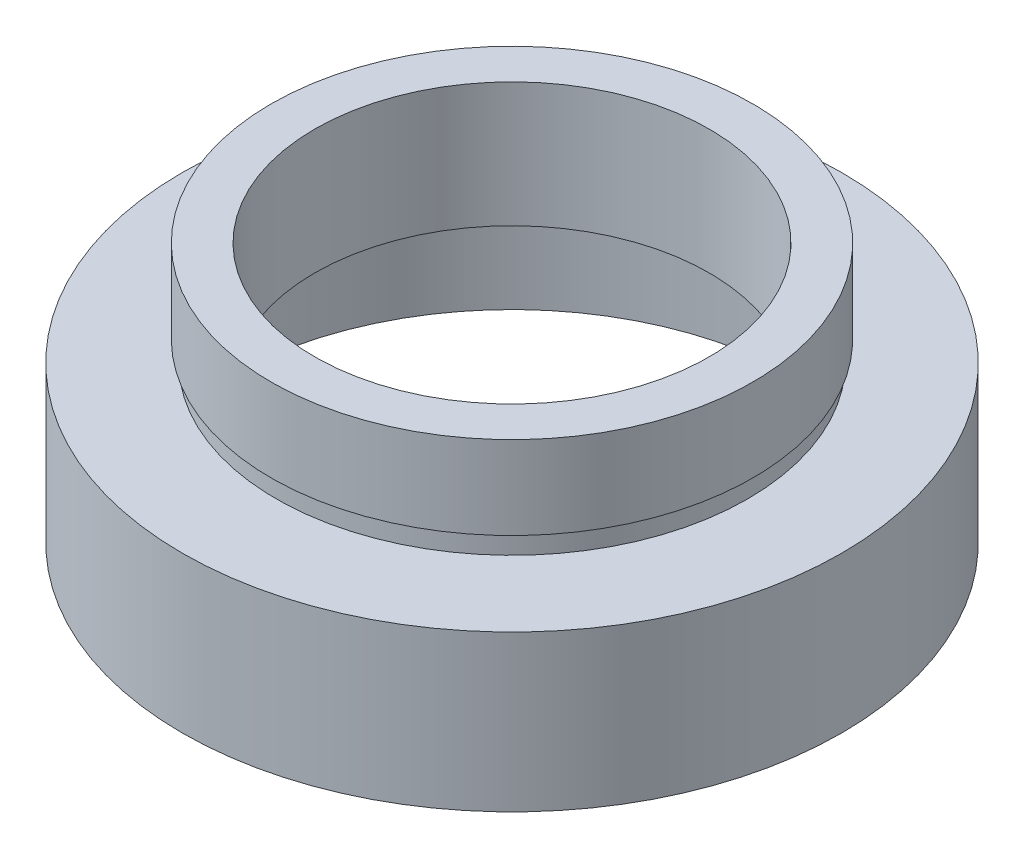
ISO-10303-21;
HEADER;
FILE_DESCRIPTION(('STEP AP214'),'2;1');
FILE_NAME('part.step','',(''),(''),'','','');
FILE_SCHEMA(('AUTOMOTIVE_DESIGN { 1 0 10303 214 1 1 1 1 }'));
ENDSEC;
DATA;
#1=APPLICATION_CONTEXT('core data for automotive mechanical design processes');
#2=APPLICATION_PROTOCOL_DEFINITION('international standard','automotive_design',2000,#1);
#3=PRODUCT_CONTEXT('',#1,'mechanical');
#4=PRODUCT('Part','Part','',(#3));
#5=PRODUCT_RELATED_PRODUCT_CATEGORY('part','',(#4));
#6=PRODUCT_DEFINITION_FORMATION('','',#4);
#7=PRODUCT_DEFINITION_CONTEXT('part definition',#1,'design');
#8=PRODUCT_DEFINITION('design','',#6,#7);
#9=PRODUCT_DEFINITION_SHAPE('','',#8);
#10=(LENGTH_UNIT() NAMED_UNIT(*) SI_UNIT(.MILLI.,.METRE.));
#11=(NAMED_UNIT(*) PLANE_ANGLE_UNIT() SI_UNIT($,.RADIAN.));
#12=(NAMED_UNIT(*) SI_UNIT($,.STERADIAN.) SOLID_ANGLE_UNIT());
#13=UNCERTAINTY_MEASURE_WITH_UNIT(LENGTH_MEASURE(1.E-05),#10,'distance_accuracy_value','');
#14=(GEOMETRIC_REPRESENTATION_CONTEXT(3) GLOBAL_UNCERTAINTY_ASSIGNED_CONTEXT((#13)) GLOBAL_UNIT_ASSIGNED_CONTEXT((#10,
#11,#12)) REPRESENTATION_CONTEXT('',''));
#15=CARTESIAN_POINT('',(0.,0.,0.));
#16=DIRECTION('',(0.,0.,1.));
#17=DIRECTION('',(1.,0.,0.));
#18=AXIS2_PLACEMENT_3D('',#15,#16,#17);
#19=CARTESIAN_POINT('',(15.875,0.,0.));
#20=DIRECTION('',(0.,1.,0.));
#21=DIRECTION('',(-1.,0.,0.));
#22=AXIS2_PLACEMENT_3D('',#19,#20,#21);
#23=PLANE('',#22);
#24=CARTESIAN_POINT('',(0.,0.,0.));
#25=DIRECTION('',(0.,1.,0.));
#26=DIRECTION('',(-1.,0.,0.));
#27=AXIS2_PLACEMENT_3D('',#24,#25,#26);
#28=CIRCLE('',#27,15.875);
#29=CARTESIAN_POINT('',(-15.875,0.,0.));
#30=VERTEX_POINT('',#29);
#31=EDGE_CURVE('E75',#30,#30,#28,.T.);
#32=ORIENTED_EDGE('',*,*,#31,.F.);
#33=EDGE_LOOP('',(#32));
#34=FACE_BOUND('',#33,.T.);
#35=CARTESIAN_POINT('',(0.,0.,0.));
#36=DIRECTION('',(0.,1.,0.));
#37=DIRECTION('',(-1.,0.,0.));
#38=AXIS2_PLACEMENT_3D('',#35,#36,#37);
#39=CIRCLE('',#38,13.75);
#40=CARTESIAN_POINT('',(-13.75,0.,0.));
#41=VERTEX_POINT('',#40);
#42=EDGE_CURVE('E10',#41,#41,#39,.T.);
#43=ORIENTED_EDGE('',*,*,#42,.T.);
#44=EDGE_LOOP('',(#43));
#45=FACE_BOUND('',#44,.T.);
#46=ADVANCED_FACE('F35',(#34,#45),#23,.F.);
#47=CARTESIAN_POINT('',(0.,16.8860182370821,0.));
#48=DIRECTION('',(0.,1.,0.));
#49=DIRECTION('',(-1.,0.,0.));
#50=AXIS2_PLACEMENT_3D('',#47,#48,#49);
#51=CYLINDRICAL_SURFACE('',#50,13.75);
#52=ORIENTED_EDGE('',*,*,#42,.F.);
#53=EDGE_LOOP('',(#52));
#54=FACE_BOUND('',#53,.T.);
#55=CARTESIAN_POINT('',(0.,5.5,0.));
#56=DIRECTION('',(0.,1.,0.));
#57=DIRECTION('',(-1.,0.,0.));
#58=AXIS2_PLACEMENT_3D('',#55,#56,#57);
#59=CIRCLE('',#58,13.75);
#60=CARTESIAN_POINT('',(-13.75,5.49999999999999,0.));
#61=VERTEX_POINT('',#60);
#62=EDGE_CURVE('E41',#61,#61,#59,.T.);
#63=ORIENTED_EDGE('',*,*,#62,.T.);
#64=EDGE_LOOP('',(#63));
#65=FACE_BOUND('',#64,.T.);
#66=ADVANCED_FACE('F82',(#54,#65),#51,.F.);
#67=CARTESIAN_POINT('',(13.75,5.5,0.));
#68=DIRECTION('',(0.,-1.,0.));
#69=DIRECTION('',(1.,0.,0.));
#70=AXIS2_PLACEMENT_3D('',#67,#68,#69);
#71=PLANE('',#70);
#72=ORIENTED_EDGE('',*,*,#62,.F.);
#73=EDGE_LOOP('',(#72));
#74=FACE_BOUND('',#73,.T.);
#75=CARTESIAN_POINT('',(0.,5.5,0.));
#76=DIRECTION('',(0.,1.,0.));
#77=DIRECTION('',(-1.,0.,0.));
#78=AXIS2_PLACEMENT_3D('',#75,#76,#77);
#79=CIRCLE('',#78,14.35);
#80=CARTESIAN_POINT('',(-14.35,5.49999999999999,0.));
#81=VERTEX_POINT('',#80);
#82=EDGE_CURVE('E45',#81,#81,#79,.T.);
#83=ORIENTED_EDGE('',*,*,#82,.T.);
#84=EDGE_LOOP('',(#83));
#85=FACE_BOUND('',#84,.T.);
#86=ADVANCED_FACE('F86',(#74,#85),#71,.F.);
#87=CARTESIAN_POINT('',(0.,16.8860182370821,0.));
#88=DIRECTION('',(0.,1.,0.));
#89=DIRECTION('',(-1.,0.,0.));
#90=AXIS2_PLACEMENT_3D('',#87,#88,#89);
#91=CYLINDRICAL_SURFACE('',#90,14.35);
#92=ORIENTED_EDGE('',*,*,#82,.F.);
#93=EDGE_LOOP('',(#92));
#94=FACE_BOUND('',#93,.T.);
#95=CARTESIAN_POINT('',(0.,6.5,0.));
#96=DIRECTION('',(0.,1.,0.));
#97=DIRECTION('',(-1.,0.,0.));
#98=AXIS2_PLACEMENT_3D('',#95,#96,#97);
#99=CIRCLE('',#98,14.35);
#100=CARTESIAN_POINT('',(-14.35,6.5,0.));
#101=VERTEX_POINT('',#100);
#102=EDGE_CURVE('E49',#101,#101,#99,.T.);
#103=ORIENTED_EDGE('',*,*,#102,.T.);
#104=EDGE_LOOP('',(#103));
#105=FACE_BOUND('',#104,.T.);
#106=ADVANCED_FACE('F91',(#94,#105),#91,.F.);
#107=CARTESIAN_POINT('',(9.5,6.5,0.));
#108=DIRECTION('',(0.,1.,0.));
#109=DIRECTION('',(-1.,0.,0.));
#110=AXIS2_PLACEMENT_3D('',#107,#108,#109);
#111=PLANE('',#110);
#112=ORIENTED_EDGE('',*,*,#102,.F.);
#113=EDGE_LOOP('',(#112));
#114=FACE_BOUND('',#113,.T.);
#115=CARTESIAN_POINT('',(0.,6.5,0.));
#116=DIRECTION('',(0.,1.,0.));
#117=DIRECTION('',(-1.,0.,0.));
#118=AXIS2_PLACEMENT_3D('',#115,#116,#117);
#119=CIRCLE('',#118,9.5);
#120=CARTESIAN_POINT('',(-9.5,6.5,0.));
#121=VERTEX_POINT('',#120);
#122=EDGE_CURVE('E54',#121,#121,#119,.T.);
#123=ORIENTED_EDGE('',*,*,#122,.T.);
#124=EDGE_LOOP('',(#123));
#125=FACE_BOUND('',#124,.T.);
#126=ADVANCED_FACE('F97',(#114,#125),#111,.F.);
#127=CARTESIAN_POINT('',(0.,16.8860182370821,0.));
#128=DIRECTION('',(0.,1.,0.));
#129=DIRECTION('',(-1.,0.,0.));
#130=AXIS2_PLACEMENT_3D('',#127,#128,#129);
#131=CYLINDRICAL_SURFACE('',#130,9.5);
#132=ORIENTED_EDGE('',*,*,#122,.F.);
#133=EDGE_LOOP('',(#132));
#134=FACE_BOUND('',#133,.T.);
#135=CARTESIAN_POINT('',(0.,12.5,0.));
#136=DIRECTION('',(0.,1.,0.));
#137=DIRECTION('',(-1.,0.,0.));
#138=AXIS2_PLACEMENT_3D('',#135,#136,#137);
#139=CIRCLE('',#138,9.5);
#140=CARTESIAN_POINT('',(-9.5,12.5,0.));
#141=VERTEX_POINT('',#140);
#142=EDGE_CURVE('E57',#141,#141,#139,.T.);
#143=ORIENTED_EDGE('',*,*,#142,.T.);
#144=EDGE_LOOP('',(#143));
#145=FACE_BOUND('',#144,.T.);
#146=ADVANCED_FACE('F101',(#134,#145),#131,.F.);
#147=CARTESIAN_POINT('',(9.5,12.5,0.));
#148=DIRECTION('',(0.,-1.,0.));
#149=DIRECTION('',(1.,0.,0.));
#150=AXIS2_PLACEMENT_3D('',#147,#148,#149);
#151=PLANE('',#150);
#152=ORIENTED_EDGE('',*,*,#142,.F.);
#153=EDGE_LOOP('',(#152));
#154=FACE_BOUND('',#153,.T.);
#155=CARTESIAN_POINT('',(0.,12.5,0.));
#156=DIRECTION('',(0.,1.,0.));
#157=DIRECTION('',(-1.,0.,0.));
#158=AXIS2_PLACEMENT_3D('',#155,#156,#157);
#159=CIRCLE('',#158,11.6);
#160=CARTESIAN_POINT('',(-11.6,12.5,0.));
#161=VERTEX_POINT('',#160);
#162=EDGE_CURVE('E60',#161,#161,#159,.T.);
#163=ORIENTED_EDGE('',*,*,#162,.T.);
#164=EDGE_LOOP('',(#163));
#165=FACE_BOUND('',#164,.T.);
#166=ADVANCED_FACE('F105',(#154,#165),#151,.F.);
#167=CARTESIAN_POINT('',(0.,16.8860182370821,0.));
#168=DIRECTION('',(0.,1.,0.));
#169=DIRECTION('',(-1.,0.,0.));
#170=AXIS2_PLACEMENT_3D('',#167,#168,#169);
#171=CYLINDRICAL_SURFACE('',#170,11.6);
#172=ORIENTED_EDGE('',*,*,#162,.F.);
#173=EDGE_LOOP('',(#172));
#174=FACE_BOUND('',#173,.T.);
#175=CARTESIAN_POINT('',(0.,8.5,0.));
#176=DIRECTION('',(0.,1.,0.));
#177=DIRECTION('',(-1.,0.,0.));
#178=AXIS2_PLACEMENT_3D('',#175,#176,#177);
#179=CIRCLE('',#178,11.6);
#180=CARTESIAN_POINT('',(-11.6,8.5,0.));
#181=VERTEX_POINT('',#180);
#182=EDGE_CURVE('E63',#181,#181,#179,.T.);
#183=ORIENTED_EDGE('',*,*,#182,.T.);
#184=EDGE_LOOP('',(#183));
#185=FACE_BOUND('',#184,.T.);
#186=ADVANCED_FACE('F109',(#174,#185),#171,.T.);
#187=CARTESIAN_POINT('',(11.6,8.5,0.));
#188=DIRECTION('',(0.,1.,0.));
#189=DIRECTION('',(-1.,0.,0.));
#190=AXIS2_PLACEMENT_3D('',#187,#188,#189);
#191=PLANE('',#190);
#192=ORIENTED_EDGE('',*,*,#182,.F.);
#193=EDGE_LOOP('',(#192));
#194=FACE_BOUND('',#193,.T.);
#195=CARTESIAN_POINT('',(0.,8.5,0.));
#196=DIRECTION('',(0.,1.,0.));
#197=DIRECTION('',(-1.,0.,0.));
#198=AXIS2_PLACEMENT_3D('',#195,#196,#197);
#199=CIRCLE('',#198,11.35);
#200=CARTESIAN_POINT('',(-11.35,8.5,0.));
#201=VERTEX_POINT('',#200);
#202=EDGE_CURVE('E66',#201,#201,#199,.T.);
#203=ORIENTED_EDGE('',*,*,#202,.T.);
#204=EDGE_LOOP('',(#203));
#205=FACE_BOUND('',#204,.T.);
#206=ADVANCED_FACE('F113',(#194,#205),#191,.F.);
#207=CARTESIAN_POINT('',(0.,16.8860182370821,0.));
#208=DIRECTION('',(0.,1.,0.));
#209=DIRECTION('',(-1.,0.,0.));
#210=AXIS2_PLACEMENT_3D('',#207,#208,#209);
#211=CYLINDRICAL_SURFACE('',#210,11.35);
#212=ORIENTED_EDGE('',*,*,#202,.F.);
#213=EDGE_LOOP('',(#212));
#214=FACE_BOUND('',#213,.T.);
#215=CARTESIAN_POINT('',(0.,7.5,0.));
#216=DIRECTION('',(0.,1.,0.));
#217=DIRECTION('',(-1.,0.,0.));
#218=AXIS2_PLACEMENT_3D('',#215,#216,#217);
#219=CIRCLE('',#218,11.35);
#220=CARTESIAN_POINT('',(-11.35,7.5,0.));
#221=VERTEX_POINT('',#220);
#222=EDGE_CURVE('E69',#221,#221,#219,.T.);
#223=ORIENTED_EDGE('',*,*,#222,.T.);
#224=EDGE_LOOP('',(#223));
#225=FACE_BOUND('',#224,.T.);
#226=ADVANCED_FACE('F117',(#214,#225),#211,.T.);
#227=CARTESIAN_POINT('',(11.35,7.5,0.));
#228=DIRECTION('',(0.,-1.,0.));
#229=DIRECTION('',(1.,0.,0.));
#230=AXIS2_PLACEMENT_3D('',#227,#228,#229);
#231=PLANE('',#230);
#232=ORIENTED_EDGE('',*,*,#222,.F.);
#233=EDGE_LOOP('',(#232));
#234=FACE_BOUND('',#233,.T.);
#235=CARTESIAN_POINT('',(0.,7.5,0.));
#236=DIRECTION('',(0.,1.,0.));
#237=DIRECTION('',(-1.,0.,0.));
#238=AXIS2_PLACEMENT_3D('',#235,#236,#237);
#239=CIRCLE('',#238,15.875);
#240=CARTESIAN_POINT('',(-15.875,7.5,0.));
#241=VERTEX_POINT('',#240);
#242=EDGE_CURVE('E72',#241,#241,#239,.T.);
#243=ORIENTED_EDGE('',*,*,#242,.T.);
#244=EDGE_LOOP('',(#243));
#245=FACE_BOUND('',#244,.T.);
#246=ADVANCED_FACE('F121',(#234,#245),#231,.F.);
#247=CARTESIAN_POINT('',(0.,16.8860182370821,0.));
#248=DIRECTION('',(0.,1.,0.));
#249=DIRECTION('',(-1.,0.,0.));
#250=AXIS2_PLACEMENT_3D('',#247,#248,#249);
#251=CYLINDRICAL_SURFACE('',#250,15.875);
#252=ORIENTED_EDGE('',*,*,#242,.F.);
#253=EDGE_LOOP('',(#252));
#254=FACE_BOUND('',#253,.T.);
#255=ORIENTED_EDGE('',*,*,#31,.T.);
#256=EDGE_LOOP('',(#255));
#257=FACE_BOUND('',#256,.T.);
#258=ADVANCED_FACE('F79',(#254,#257),#251,.T.);
#259=CLOSED_SHELL('',(#46,#66,#86,#106,#126,#146,#166,#186,#206,#226,#246,#258));
#260=MANIFOLD_SOLID_BREP('B2',#259);
#261=ADVANCED_BREP_SHAPE_REPRESENTATION('',(#18,#260),#14);
#262=SHAPE_DEFINITION_REPRESENTATION(#9,#261);
ENDSEC;
END-ISO-10303-21;
